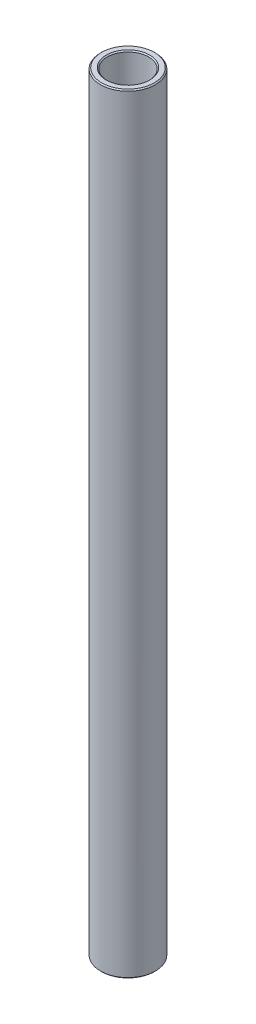
ISO-10303-21;
HEADER;
FILE_DESCRIPTION(('STEP AP214'),'2;1');
FILE_NAME('part.step','',(''),(''),'','','');
FILE_SCHEMA(('AUTOMOTIVE_DESIGN { 1 0 10303 214 1 1 1 1 }'));
ENDSEC;
DATA;
#1=APPLICATION_CONTEXT('core data for automotive mechanical design processes');
#2=APPLICATION_PROTOCOL_DEFINITION('international standard','automotive_design',2000,#1);
#3=PRODUCT_CONTEXT('',#1,'mechanical');
#4=PRODUCT('Part','Part','',(#3));
#5=PRODUCT_RELATED_PRODUCT_CATEGORY('part','',(#4));
#6=PRODUCT_DEFINITION_FORMATION('','',#4);
#7=PRODUCT_DEFINITION_CONTEXT('part definition',#1,'design');
#8=PRODUCT_DEFINITION('design','',#6,#7);
#9=PRODUCT_DEFINITION_SHAPE('','',#8);
#10=(LENGTH_UNIT() NAMED_UNIT(*) SI_UNIT(.MILLI.,.METRE.));
#11=(NAMED_UNIT(*) PLANE_ANGLE_UNIT() SI_UNIT($,.RADIAN.));
#12=(NAMED_UNIT(*) SI_UNIT($,.STERADIAN.) SOLID_ANGLE_UNIT());
#13=UNCERTAINTY_MEASURE_WITH_UNIT(LENGTH_MEASURE(1.E-05),#10,'distance_accuracy_value','');
#14=(GEOMETRIC_REPRESENTATION_CONTEXT(3) GLOBAL_UNCERTAINTY_ASSIGNED_CONTEXT((#13)) GLOBAL_UNIT_ASSIGNED_CONTEXT((#10,
#11,#12)) REPRESENTATION_CONTEXT('',''));
#15=CARTESIAN_POINT('',(0.,0.,0.));
#16=DIRECTION('',(0.,0.,1.));
#17=DIRECTION('',(1.,0.,0.));
#18=AXIS2_PLACEMENT_3D('',#15,#16,#17);
#19=CARTESIAN_POINT('',(0.,11.60859375,0.));
#20=DIRECTION('',(0.,1.,0.));
#21=DIRECTION('',(-1.,0.,0.));
#22=AXIS2_PLACEMENT_3D('',#19,#20,#21);
#23=CYLINDRICAL_SURFACE('',#22,4.7625);
#24=CARTESIAN_POINT('',(0.,-88.646,0.));
#25=DIRECTION('',(0.,1.,0.));
#26=DIRECTION('',(-1.,0.,0.));
#27=AXIS2_PLACEMENT_3D('',#24,#25,#26);
#28=CIRCLE('',#27,4.7625);
#29=CARTESIAN_POINT('',(-4.76250000000001,-88.646,0.));
#30=VERTEX_POINT('',#29);
#31=EDGE_CURVE('E64',#30,#30,#28,.F.);
#32=ORIENTED_EDGE('',*,*,#31,.T.);
#33=EDGE_LOOP('',(#32));
#34=FACE_BOUND('',#33,.T.);
#35=CARTESIAN_POINT('',(0.,88.646,0.));
#36=DIRECTION('',(0.,-1.,0.));
#37=DIRECTION('',(1.,0.,0.));
#38=AXIS2_PLACEMENT_3D('',#35,#36,#37);
#39=CIRCLE('',#38,4.7625);
#40=CARTESIAN_POINT('',(4.76250000000001,88.646,0.));
#41=VERTEX_POINT('',#40);
#42=EDGE_CURVE('E67',#41,#41,#39,.F.);
#43=ORIENTED_EDGE('',*,*,#42,.T.);
#44=EDGE_LOOP('',(#43));
#45=FACE_BOUND('',#44,.T.);
#46=ADVANCED_FACE('F38',(#34,#45),#23,.F.);
#47=CARTESIAN_POINT('',(4.76249999999999,88.9,0.));
#48=DIRECTION('',(0.,-1.,0.));
#49=DIRECTION('',(1.,0.,0.));
#50=AXIS2_PLACEMENT_3D('',#47,#48,#49);
#51=PLANE('',#50);
#52=CARTESIAN_POINT('',(0.,88.9,0.));
#53=DIRECTION('',(0.,-1.,0.));
#54=DIRECTION('',(1.,0.,0.));
#55=AXIS2_PLACEMENT_3D('',#52,#53,#54);
#56=CIRCLE('',#55,6.09599999999999);
#57=CARTESIAN_POINT('',(6.096,88.9,0.));
#58=VERTEX_POINT('',#57);
#59=EDGE_CURVE('E10',#58,#58,#56,.F.);
#60=ORIENTED_EDGE('',*,*,#59,.T.);
#61=EDGE_LOOP('',(#60));
#62=FACE_BOUND('',#61,.T.);
#63=CARTESIAN_POINT('',(0.,88.9,0.));
#64=DIRECTION('',(0.,-1.,0.));
#65=DIRECTION('',(1.,0.,0.));
#66=AXIS2_PLACEMENT_3D('',#63,#64,#65);
#67=CIRCLE('',#66,5.01649999999995);
#68=CARTESIAN_POINT('',(5.01649999999996,88.9,0.));
#69=VERTEX_POINT('',#68);
#70=EDGE_CURVE('E46',#69,#69,#67,.T.);
#71=ORIENTED_EDGE('',*,*,#70,.T.);
#72=EDGE_LOOP('',(#71));
#73=FACE_BOUND('',#72,.T.);
#74=ADVANCED_FACE('F92',(#62,#73),#51,.F.);
#75=CARTESIAN_POINT('',(0.,11.60859375,0.));
#76=DIRECTION('',(0.,1.,0.));
#77=DIRECTION('',(-1.,0.,0.));
#78=AXIS2_PLACEMENT_3D('',#75,#76,#77);
#79=CYLINDRICAL_SURFACE('',#78,6.35);
#80=CARTESIAN_POINT('',(0.,-88.646,0.));
#81=DIRECTION('',(0.,1.,0.));
#82=DIRECTION('',(-1.,0.,0.));
#83=AXIS2_PLACEMENT_3D('',#80,#81,#82);
#84=CIRCLE('',#83,6.35);
#85=CARTESIAN_POINT('',(-6.35000000000001,-88.646,0.));
#86=VERTEX_POINT('',#85);
#87=EDGE_CURVE('E53',#86,#86,#84,.T.);
#88=ORIENTED_EDGE('',*,*,#87,.T.);
#89=EDGE_LOOP('',(#88));
#90=FACE_BOUND('',#89,.T.);
#91=CARTESIAN_POINT('',(0.,88.646,0.));
#92=DIRECTION('',(0.,-1.,0.));
#93=DIRECTION('',(1.,0.,0.));
#94=AXIS2_PLACEMENT_3D('',#91,#92,#93);
#95=CIRCLE('',#94,6.35);
#96=CARTESIAN_POINT('',(6.35000000000001,88.646,0.));
#97=VERTEX_POINT('',#96);
#98=EDGE_CURVE('E59',#97,#97,#95,.T.);
#99=ORIENTED_EDGE('',*,*,#98,.T.);
#100=EDGE_LOOP('',(#99));
#101=FACE_BOUND('',#100,.T.);
#102=ADVANCED_FACE('F89',(#90,#101),#79,.T.);
#103=CARTESIAN_POINT('',(6.35000000000001,-88.9,0.));
#104=DIRECTION('',(0.,1.,0.));
#105=DIRECTION('',(-1.,0.,0.));
#106=AXIS2_PLACEMENT_3D('',#103,#104,#105);
#107=PLANE('',#106);
#108=CARTESIAN_POINT('',(0.,-88.9,0.));
#109=DIRECTION('',(0.,1.,0.));
#110=DIRECTION('',(-1.,0.,0.));
#111=AXIS2_PLACEMENT_3D('',#108,#109,#110);
#112=CIRCLE('',#111,5.01650000000001);
#113=CARTESIAN_POINT('',(-5.01650000000001,-88.9,0.));
#114=VERTEX_POINT('',#113);
#115=EDGE_CURVE('E70',#114,#114,#112,.T.);
#116=ORIENTED_EDGE('',*,*,#115,.T.);
#117=EDGE_LOOP('',(#116));
#118=FACE_BOUND('',#117,.T.);
#119=CARTESIAN_POINT('',(0.,-88.9,0.));
#120=DIRECTION('',(0.,1.,0.));
#121=DIRECTION('',(-1.,0.,0.));
#122=AXIS2_PLACEMENT_3D('',#119,#120,#121);
#123=CIRCLE('',#122,6.09600000000006);
#124=CARTESIAN_POINT('',(-6.09600000000007,-88.9,0.));
#125=VERTEX_POINT('',#124);
#126=EDGE_CURVE('E74',#125,#125,#123,.F.);
#127=ORIENTED_EDGE('',*,*,#126,.T.);
#128=EDGE_LOOP('',(#127));
#129=FACE_BOUND('',#128,.T.);
#130=ADVANCED_FACE('F79',(#118,#129),#107,.F.);
#131=CARTESIAN_POINT('',(0.,-88.9,0.));
#132=DIRECTION('',(0.,-1.,0.));
#133=DIRECTION('',(1.,0.,0.));
#134=AXIS2_PLACEMENT_3D('',#131,#132,#133);
#135=CONICAL_SURFACE('',#134,5.01650000000001,0.785398163397482);
#136=ORIENTED_EDGE('',*,*,#31,.F.);
#137=EDGE_LOOP('',(#136));
#138=FACE_BOUND('',#137,.T.);
#139=ORIENTED_EDGE('',*,*,#115,.F.);
#140=EDGE_LOOP('',(#139));
#141=FACE_BOUND('',#140,.T.);
#142=ADVANCED_FACE('F85',(#138,#141),#135,.F.);
#143=CARTESIAN_POINT('',(0.,-88.646,0.));
#144=DIRECTION('',(0.,1.,0.));
#145=DIRECTION('',(-1.,0.,0.));
#146=AXIS2_PLACEMENT_3D('',#143,#144,#145);
#147=CONICAL_SURFACE('',#146,6.35,0.785398163397406);
#148=ORIENTED_EDGE('',*,*,#126,.F.);
#149=EDGE_LOOP('',(#148));
#150=FACE_BOUND('',#149,.T.);
#151=ORIENTED_EDGE('',*,*,#87,.F.);
#152=EDGE_LOOP('',(#151));
#153=FACE_BOUND('',#152,.T.);
#154=ADVANCED_FACE('F81',(#150,#153),#147,.T.);
#155=CARTESIAN_POINT('',(0.,88.9,0.));
#156=DIRECTION('',(0.,-1.,0.));
#157=DIRECTION('',(1.,0.,0.));
#158=AXIS2_PLACEMENT_3D('',#155,#156,#157);
#159=CONICAL_SURFACE('',#158,6.09599999999999,0.785398163397406);
#160=ORIENTED_EDGE('',*,*,#98,.F.);
#161=EDGE_LOOP('',(#160));
#162=FACE_BOUND('',#161,.T.);
#163=ORIENTED_EDGE('',*,*,#59,.F.);
#164=EDGE_LOOP('',(#163));
#165=FACE_BOUND('',#164,.T.);
#166=ADVANCED_FACE('F84',(#162,#165),#159,.T.);
#167=CARTESIAN_POINT('',(0.,88.646,0.));
#168=DIRECTION('',(0.,1.,0.));
#169=DIRECTION('',(-1.,0.,0.));
#170=AXIS2_PLACEMENT_3D('',#167,#168,#169);
#171=CONICAL_SURFACE('',#170,4.7625,0.785398163397428);
#172=ORIENTED_EDGE('',*,*,#70,.F.);
#173=EDGE_LOOP('',(#172));
#174=FACE_BOUND('',#173,.T.);
#175=ORIENTED_EDGE('',*,*,#42,.F.);
#176=EDGE_LOOP('',(#175));
#177=FACE_BOUND('',#176,.T.);
#178=ADVANCED_FACE('F40',(#174,#177),#171,.F.);
#179=CLOSED_SHELL('',(#46,#74,#102,#130,#142,#154,#166,#178));
#180=MANIFOLD_SOLID_BREP('B2',#179);
#181=ADVANCED_BREP_SHAPE_REPRESENTATION('',(#18,#180),#14);
#182=SHAPE_DEFINITION_REPRESENTATION(#9,#181);
ENDSEC;
END-ISO-10303-21;
